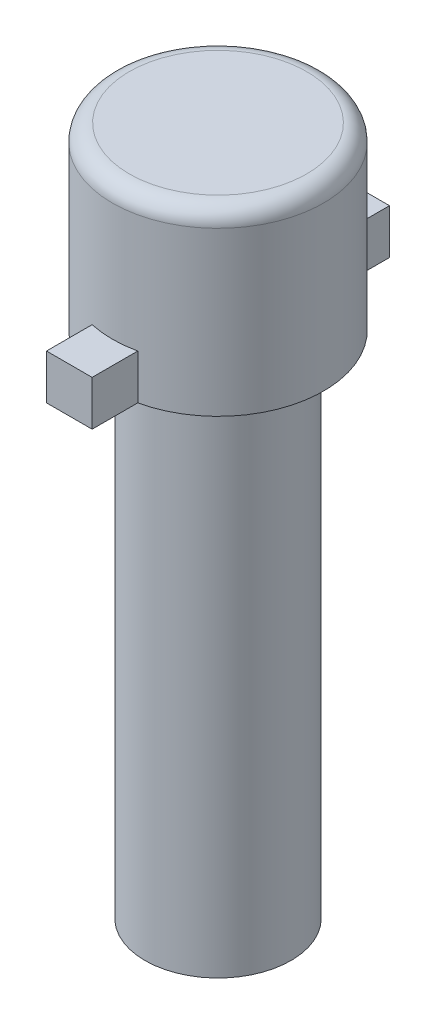
ISO-10303-21;
HEADER;
FILE_DESCRIPTION(('STEP AP214'),'2;1');
FILE_NAME('part.step','',(''),(''),'','','');
FILE_SCHEMA(('AUTOMOTIVE_DESIGN { 1 0 10303 214 1 1 1 1 }'));
ENDSEC;
DATA;
#1=APPLICATION_CONTEXT('core data for automotive mechanical design processes');
#2=APPLICATION_PROTOCOL_DEFINITION('international standard','automotive_design',2000,#1);
#3=PRODUCT_CONTEXT('',#1,'mechanical');
#4=PRODUCT('Part','Part','',(#3));
#5=PRODUCT_RELATED_PRODUCT_CATEGORY('part','',(#4));
#6=PRODUCT_DEFINITION_FORMATION('','',#4);
#7=PRODUCT_DEFINITION_CONTEXT('part definition',#1,'design');
#8=PRODUCT_DEFINITION('design','',#6,#7);
#9=PRODUCT_DEFINITION_SHAPE('','',#8);
#10=(LENGTH_UNIT() NAMED_UNIT(*) SI_UNIT(.MILLI.,.METRE.));
#11=(NAMED_UNIT(*) PLANE_ANGLE_UNIT() SI_UNIT($,.RADIAN.));
#12=(NAMED_UNIT(*) SI_UNIT($,.STERADIAN.) SOLID_ANGLE_UNIT());
#13=UNCERTAINTY_MEASURE_WITH_UNIT(LENGTH_MEASURE(1.E-05),#10,'distance_accuracy_value','');
#14=(GEOMETRIC_REPRESENTATION_CONTEXT(3) GLOBAL_UNCERTAINTY_ASSIGNED_CONTEXT((#13)) GLOBAL_UNIT_ASSIGNED_CONTEXT((#10,
#11,#12)) REPRESENTATION_CONTEXT('',''));
#15=CARTESIAN_POINT('',(0.,0.,0.));
#16=DIRECTION('',(0.,0.,1.));
#17=DIRECTION('',(1.,0.,0.));
#18=AXIS2_PLACEMENT_3D('',#15,#16,#17);
#19=CARTESIAN_POINT('',(0.,22.686,0.));
#20=DIRECTION('',(0.,-1.,0.));
#21=DIRECTION('',(0.,0.,-1.));
#22=AXIS2_PLACEMENT_3D('',#19,#20,#21);
#23=CYLINDRICAL_SURFACE('',#22,3.25);
#24=CARTESIAN_POINT('',(0.,22.686,0.));
#25=DIRECTION('',(0.,1.,0.));
#26=DIRECTION('',(0.,0.,1.));
#27=AXIS2_PLACEMENT_3D('',#24,#25,#26);
#28=CIRCLE('',#27,3.25);
#29=CARTESIAN_POINT('',(0.,22.686,3.25));
#30=VERTEX_POINT('',#29);
#31=EDGE_CURVE('E220',#30,#30,#28,.T.);
#32=ORIENTED_EDGE('',*,*,#31,.F.);
#33=EDGE_LOOP('',(#32));
#34=FACE_BOUND('',#33,.T.);
#35=CARTESIAN_POINT('',(0.,0.,0.));
#36=DIRECTION('',(0.,1.,0.));
#37=DIRECTION('',(0.,0.,1.));
#38=AXIS2_PLACEMENT_3D('',#35,#36,#37);
#39=CIRCLE('',#38,3.25);
#40=CARTESIAN_POINT('',(0.,0.,3.25));
#41=VERTEX_POINT('',#40);
#42=EDGE_CURVE('E219',#41,#41,#39,.T.);
#43=ORIENTED_EDGE('',*,*,#42,.T.);
#44=EDGE_LOOP('',(#43));
#45=FACE_BOUND('',#44,.T.);
#46=ADVANCED_FACE('F63',(#34,#45),#23,.T.);
#47=CARTESIAN_POINT('',(0.,0.,0.));
#48=DIRECTION('',(0.,1.,0.));
#49=DIRECTION('',(0.,0.,1.));
#50=AXIS2_PLACEMENT_3D('',#47,#48,#49);
#51=PLANE('',#50);
#52=ORIENTED_EDGE('',*,*,#42,.F.);
#53=EDGE_LOOP('',(#52));
#54=FACE_BOUND('',#53,.T.);
#55=ADVANCED_FACE('F249',(#54),#51,.F.);
#56=CARTESIAN_POINT('',(0.,30.686,0.));
#57=DIRECTION('',(0.,-1.,0.));
#58=DIRECTION('',(0.,0.,-1.));
#59=AXIS2_PLACEMENT_3D('',#56,#57,#58);
#60=CYLINDRICAL_SURFACE('',#59,4.7);
#61=CARTESIAN_POINT('',(0.,22.686,0.));
#62=DIRECTION('',(0.,1.,0.));
#63=DIRECTION('',(0.,0.,1.));
#64=AXIS2_PLACEMENT_3D('',#61,#62,#63);
#65=CIRCLE('',#64,4.7);
#66=CARTESIAN_POINT('',(-1.016,22.686,-4.58887175676113));
#67=VERTEX_POINT('',#66);
#68=CARTESIAN_POINT('',(-1.016,22.686,4.58887175676113));
#69=VERTEX_POINT('',#68);
#70=EDGE_CURVE('E171',#67,#69,#65,.T.);
#71=ORIENTED_EDGE('',*,*,#70,.T.);
#72=DIRECTION('',(0.,-1.,0.));
#73=VECTOR('',#72,1.);
#74=CARTESIAN_POINT('',(-1.016,24.686,4.58887175676113));
#75=LINE('',#74,#73);
#76=CARTESIAN_POINT('',(-1.016,24.686,4.58887175676113));
#77=VERTEX_POINT('',#76);
#78=EDGE_CURVE('E79',#77,#69,#75,.T.);
#79=ORIENTED_EDGE('',*,*,#78,.F.);
#80=CARTESIAN_POINT('',(0.,24.686,0.));
#81=DIRECTION('',(0.,1.,0.));
#82=DIRECTION('',(0.,0.,-1.));
#83=AXIS2_PLACEMENT_3D('',#80,#81,#82);
#84=CIRCLE('',#83,4.7);
#85=CARTESIAN_POINT('',(1.016,24.686,4.58887175676113));
#86=VERTEX_POINT('',#85);
#87=EDGE_CURVE('E83',#77,#86,#84,.T.);
#88=ORIENTED_EDGE('',*,*,#87,.T.);
#89=DIRECTION('',(0.,-1.,0.));
#90=VECTOR('',#89,1.);
#91=CARTESIAN_POINT('',(1.016,24.686,4.58887175676113));
#92=LINE('',#91,#90);
#93=CARTESIAN_POINT('',(1.016,22.686,4.58887175676113));
#94=VERTEX_POINT('',#93);
#95=EDGE_CURVE('E141',#86,#94,#92,.T.);
#96=ORIENTED_EDGE('',*,*,#95,.T.);
#97=CARTESIAN_POINT('',(1.016,22.686,-4.58887175676113));
#98=VERTEX_POINT('',#97);
#99=EDGE_CURVE('E216',#94,#98,#65,.T.);
#100=ORIENTED_EDGE('',*,*,#99,.T.);
#101=DIRECTION('',(0.,-1.,0.));
#102=VECTOR('',#101,1.);
#103=CARTESIAN_POINT('',(1.016,24.686,-4.58887175676113));
#104=LINE('',#103,#102);
#105=CARTESIAN_POINT('',(1.016,24.686,-4.58887175676113));
#106=VERTEX_POINT('',#105);
#107=EDGE_CURVE('E187',#106,#98,#104,.T.);
#108=ORIENTED_EDGE('',*,*,#107,.F.);
#109=CARTESIAN_POINT('',(0.,24.686,0.));
#110=DIRECTION('',(0.,1.,0.));
#111=DIRECTION('',(0.,0.,1.));
#112=AXIS2_PLACEMENT_3D('',#109,#110,#111);
#113=CIRCLE('',#112,4.7);
#114=CARTESIAN_POINT('',(-1.016,24.686,-4.58887175676113));
#115=VERTEX_POINT('',#114);
#116=EDGE_CURVE('E196',#106,#115,#113,.T.);
#117=ORIENTED_EDGE('',*,*,#116,.T.);
#118=DIRECTION('',(0.,-1.,0.));
#119=VECTOR('',#118,1.);
#120=CARTESIAN_POINT('',(-1.016,24.686,-4.58887175676113));
#121=LINE('',#120,#119);
#122=EDGE_CURVE('E176',#115,#67,#121,.T.);
#123=ORIENTED_EDGE('',*,*,#122,.T.);
#124=EDGE_LOOP('',(#71,#79,#88,#96,#100,#108,#117,#123));
#125=FACE_BOUND('',#124,.T.);
#126=CARTESIAN_POINT('',(0.,29.936,0.));
#127=DIRECTION('',(0.,1.,0.));
#128=DIRECTION('',(0.,0.,1.));
#129=AXIS2_PLACEMENT_3D('',#126,#127,#128);
#130=CIRCLE('',#129,4.7);
#131=CARTESIAN_POINT('',(0.,29.936,4.7));
#132=VERTEX_POINT('',#131);
#133=EDGE_CURVE('E12',#132,#132,#130,.F.);
#134=ORIENTED_EDGE('',*,*,#133,.T.);
#135=EDGE_LOOP('',(#134));
#136=FACE_BOUND('',#135,.T.);
#137=ADVANCED_FACE('F254',(#125,#136),#60,.T.);
#138=CARTESIAN_POINT('',(0.,30.686,0.));
#139=DIRECTION('',(0.,1.,0.));
#140=DIRECTION('',(0.,0.,1.));
#141=AXIS2_PLACEMENT_3D('',#138,#139,#140);
#142=PLANE('',#141);
#143=CARTESIAN_POINT('',(0.,30.686,0.));
#144=DIRECTION('',(0.,1.,0.));
#145=DIRECTION('',(0.,0.,1.));
#146=AXIS2_PLACEMENT_3D('',#143,#144,#145);
#147=CIRCLE('',#146,3.95);
#148=CARTESIAN_POINT('',(0.,30.686,3.95));
#149=VERTEX_POINT('',#148);
#150=EDGE_CURVE('E72',#149,#149,#147,.T.);
#151=ORIENTED_EDGE('',*,*,#150,.T.);
#152=EDGE_LOOP('',(#151));
#153=FACE_BOUND('',#152,.T.);
#154=ADVANCED_FACE('F230',(#153),#142,.T.);
#155=CARTESIAN_POINT('',(0.,22.686,0.));
#156=DIRECTION('',(0.,1.,0.));
#157=DIRECTION('',(0.,0.,1.));
#158=AXIS2_PLACEMENT_3D('',#155,#156,#157);
#159=PLANE('',#158);
#160=ORIENTED_EDGE('',*,*,#31,.T.);
#161=EDGE_LOOP('',(#160));
#162=FACE_BOUND('',#161,.T.);
#163=ORIENTED_EDGE('',*,*,#99,.F.);
#164=DIRECTION('',(0.,0.,1.));
#165=VECTOR('',#164,1.);
#166=CARTESIAN_POINT('',(1.016,22.686,6.62087175676113));
#167=LINE('',#166,#165);
#168=CARTESIAN_POINT('',(1.016,22.686,6.62087175676113));
#169=VERTEX_POINT('',#168);
#170=EDGE_CURVE('E160',#94,#169,#167,.T.);
#171=ORIENTED_EDGE('',*,*,#170,.T.);
#172=DIRECTION('',(-1.,0.,0.));
#173=VECTOR('',#172,1.);
#174=CARTESIAN_POINT('',(-1.016,22.686,6.62087175676113));
#175=LINE('',#174,#173);
#176=CARTESIAN_POINT('',(-1.016,22.686,6.62087175676113));
#177=VERTEX_POINT('',#176);
#178=EDGE_CURVE('E134',#169,#177,#175,.T.);
#179=ORIENTED_EDGE('',*,*,#178,.T.);
#180=DIRECTION('',(0.,0.,-1.));
#181=VECTOR('',#180,1.);
#182=CARTESIAN_POINT('',(-1.016,22.686,4.58887175676113));
#183=LINE('',#182,#181);
#184=EDGE_CURVE('E155',#177,#69,#183,.T.);
#185=ORIENTED_EDGE('',*,*,#184,.T.);
#186=ORIENTED_EDGE('',*,*,#70,.F.);
#187=DIRECTION('',(0.,0.,-1.));
#188=VECTOR('',#187,1.);
#189=CARTESIAN_POINT('',(-1.016,22.686,-4.58887175676113));
#190=LINE('',#189,#188);
#191=CARTESIAN_POINT('',(-1.016,22.686,-6.62087175676113));
#192=VERTEX_POINT('',#191);
#193=EDGE_CURVE('E163',#67,#192,#190,.T.);
#194=ORIENTED_EDGE('',*,*,#193,.T.);
#195=DIRECTION('',(1.,0.,0.));
#196=VECTOR('',#195,1.);
#197=CARTESIAN_POINT('',(-1.016,22.686,-6.62087175676113));
#198=LINE('',#197,#196);
#199=CARTESIAN_POINT('',(1.016,22.686,-6.62087175676113));
#200=VERTEX_POINT('',#199);
#201=EDGE_CURVE('E195',#192,#200,#198,.T.);
#202=ORIENTED_EDGE('',*,*,#201,.T.);
#203=DIRECTION('',(0.,0.,1.));
#204=VECTOR('',#203,1.);
#205=CARTESIAN_POINT('',(1.016,22.686,-6.62087175676113));
#206=LINE('',#205,#204);
#207=EDGE_CURVE('E191',#200,#98,#206,.T.);
#208=ORIENTED_EDGE('',*,*,#207,.T.);
#209=EDGE_LOOP('',(#163,#171,#179,#185,#186,#194,#202,#208));
#210=FACE_BOUND('',#209,.T.);
#211=ADVANCED_FACE('F234',(#162,#210),#159,.F.);
#212=CARTESIAN_POINT('',(0.,29.936,0.));
#213=DIRECTION('',(0.,1.,0.));
#214=DIRECTION('',(0.,0.,1.));
#215=AXIS2_PLACEMENT_3D('',#212,#213,#214);
#216=TOROIDAL_SURFACE('',#215,3.95,0.75);
#217=ORIENTED_EDGE('',*,*,#133,.F.);
#218=EDGE_LOOP('',(#217));
#219=FACE_BOUND('',#218,.T.);
#220=ORIENTED_EDGE('',*,*,#150,.F.);
#221=EDGE_LOOP('',(#220));
#222=FACE_BOUND('',#221,.T.);
#223=ADVANCED_FACE('F65',(#219,#222),#216,.T.);
#224=CARTESIAN_POINT('',(1.016,24.686,-6.62087175676113));
#225=DIRECTION('',(1.,0.,0.));
#226=DIRECTION('',(0.,0.,-1.));
#227=AXIS2_PLACEMENT_3D('',#224,#225,#226);
#228=PLANE('',#227);
#229=ORIENTED_EDGE('',*,*,#207,.F.);
#230=DIRECTION('',(0.,-1.,0.));
#231=VECTOR('',#230,1.);
#232=CARTESIAN_POINT('',(1.016,24.686,-6.62087175676113));
#233=LINE('',#232,#231);
#234=CARTESIAN_POINT('',(1.016,24.686,-6.62087175676113));
#235=VERTEX_POINT('',#234);
#236=EDGE_CURVE('E184',#235,#200,#233,.T.);
#237=ORIENTED_EDGE('',*,*,#236,.F.);
#238=DIRECTION('',(0.,0.,1.));
#239=VECTOR('',#238,1.);
#240=CARTESIAN_POINT('',(1.016,24.686,-6.62087175676113));
#241=LINE('',#240,#239);
#242=EDGE_CURVE('E180',#235,#106,#241,.T.);
#243=ORIENTED_EDGE('',*,*,#242,.T.);
#244=ORIENTED_EDGE('',*,*,#107,.T.);
#245=EDGE_LOOP('',(#229,#237,#243,#244));
#246=FACE_BOUND('',#245,.T.);
#247=ADVANCED_FACE('F233',(#246),#228,.T.);
#248=CARTESIAN_POINT('',(-1.016,24.686,-6.62087175676113));
#249=DIRECTION('',(0.,0.,-1.));
#250=DIRECTION('',(-1.,0.,0.));
#251=AXIS2_PLACEMENT_3D('',#248,#249,#250);
#252=PLANE('',#251);
#253=ORIENTED_EDGE('',*,*,#201,.F.);
#254=DIRECTION('',(0.,-1.,0.));
#255=VECTOR('',#254,1.);
#256=CARTESIAN_POINT('',(-1.016,24.686,-6.62087175676113));
#257=LINE('',#256,#255);
#258=CARTESIAN_POINT('',(-1.016,24.686,-6.62087175676113));
#259=VERTEX_POINT('',#258);
#260=EDGE_CURVE('E181',#259,#192,#257,.T.);
#261=ORIENTED_EDGE('',*,*,#260,.F.);
#262=DIRECTION('',(1.,0.,0.));
#263=VECTOR('',#262,1.);
#264=CARTESIAN_POINT('',(-1.016,24.686,-6.62087175676113));
#265=LINE('',#264,#263);
#266=EDGE_CURVE('E206',#259,#235,#265,.T.);
#267=ORIENTED_EDGE('',*,*,#266,.T.);
#268=ORIENTED_EDGE('',*,*,#236,.T.);
#269=EDGE_LOOP('',(#253,#261,#267,#268));
#270=FACE_BOUND('',#269,.T.);
#271=ADVANCED_FACE('F241',(#270),#252,.T.);
#272=CARTESIAN_POINT('',(-1.016,24.686,-4.58887175676113));
#273=DIRECTION('',(-1.,0.,0.));
#274=DIRECTION('',(0.,0.,1.));
#275=AXIS2_PLACEMENT_3D('',#272,#273,#274);
#276=PLANE('',#275);
#277=ORIENTED_EDGE('',*,*,#193,.F.);
#278=ORIENTED_EDGE('',*,*,#122,.F.);
#279=DIRECTION('',(0.,0.,-1.));
#280=VECTOR('',#279,1.);
#281=CARTESIAN_POINT('',(-1.016,24.686,-4.58887175676113));
#282=LINE('',#281,#280);
#283=EDGE_CURVE('E210',#115,#259,#282,.T.);
#284=ORIENTED_EDGE('',*,*,#283,.T.);
#285=ORIENTED_EDGE('',*,*,#260,.T.);
#286=EDGE_LOOP('',(#277,#278,#284,#285));
#287=FACE_BOUND('',#286,.T.);
#288=ADVANCED_FACE('F265',(#287),#276,.T.);
#289=CARTESIAN_POINT('',(0.,24.686,0.));
#290=DIRECTION('',(0.,1.,0.));
#291=DIRECTION('',(0.,0.,1.));
#292=AXIS2_PLACEMENT_3D('',#289,#290,#291);
#293=PLANE('',#292);
#294=ORIENTED_EDGE('',*,*,#116,.F.);
#295=ORIENTED_EDGE('',*,*,#242,.F.);
#296=ORIENTED_EDGE('',*,*,#266,.F.);
#297=ORIENTED_EDGE('',*,*,#283,.F.);
#298=EDGE_LOOP('',(#294,#295,#296,#297));
#299=FACE_BOUND('',#298,.T.);
#300=ADVANCED_FACE('F262',(#299),#293,.T.);
#301=CARTESIAN_POINT('',(-1.016,24.686,4.58887175676113));
#302=DIRECTION('',(-1.,0.,0.));
#303=DIRECTION('',(0.,0.,1.));
#304=AXIS2_PLACEMENT_3D('',#301,#302,#303);
#305=PLANE('',#304);
#306=ORIENTED_EDGE('',*,*,#184,.F.);
#307=DIRECTION('',(0.,-1.,0.));
#308=VECTOR('',#307,1.);
#309=CARTESIAN_POINT('',(-1.016,24.686,6.62087175676113));
#310=LINE('',#309,#308);
#311=CARTESIAN_POINT('',(-1.016,24.686,6.62087175676113));
#312=VERTEX_POINT('',#311);
#313=EDGE_CURVE('E140',#312,#177,#310,.T.);
#314=ORIENTED_EDGE('',*,*,#313,.F.);
#315=DIRECTION('',(0.,0.,-1.));
#316=VECTOR('',#315,1.);
#317=CARTESIAN_POINT('',(-1.016,24.686,4.58887175676113));
#318=LINE('',#317,#316);
#319=EDGE_CURVE('E148',#312,#77,#318,.T.);
#320=ORIENTED_EDGE('',*,*,#319,.T.);
#321=ORIENTED_EDGE('',*,*,#78,.T.);
#322=EDGE_LOOP('',(#306,#314,#320,#321));
#323=FACE_BOUND('',#322,.T.);
#324=ADVANCED_FACE('F264',(#323),#305,.T.);
#325=CARTESIAN_POINT('',(-1.016,24.686,6.62087175676113));
#326=DIRECTION('',(0.,0.,1.));
#327=DIRECTION('',(1.,0.,0.));
#328=AXIS2_PLACEMENT_3D('',#325,#326,#327);
#329=PLANE('',#328);
#330=ORIENTED_EDGE('',*,*,#178,.F.);
#331=DIRECTION('',(0.,-1.,0.));
#332=VECTOR('',#331,1.);
#333=CARTESIAN_POINT('',(1.016,24.686,6.62087175676113));
#334=LINE('',#333,#332);
#335=CARTESIAN_POINT('',(1.016,24.686,6.62087175676113));
#336=VERTEX_POINT('',#335);
#337=EDGE_CURVE('E128',#336,#169,#334,.T.);
#338=ORIENTED_EDGE('',*,*,#337,.F.);
#339=DIRECTION('',(-1.,0.,0.));
#340=VECTOR('',#339,1.);
#341=CARTESIAN_POINT('',(-1.016,24.686,6.62087175676113));
#342=LINE('',#341,#340);
#343=EDGE_CURVE('E131',#336,#312,#342,.T.);
#344=ORIENTED_EDGE('',*,*,#343,.T.);
#345=ORIENTED_EDGE('',*,*,#313,.T.);
#346=EDGE_LOOP('',(#330,#338,#344,#345));
#347=FACE_BOUND('',#346,.T.);
#348=ADVANCED_FACE('F130',(#347),#329,.T.);
#349=CARTESIAN_POINT('',(1.016,24.686,6.62087175676113));
#350=DIRECTION('',(1.,0.,0.));
#351=DIRECTION('',(0.,0.,-1.));
#352=AXIS2_PLACEMENT_3D('',#349,#350,#351);
#353=PLANE('',#352);
#354=ORIENTED_EDGE('',*,*,#170,.F.);
#355=ORIENTED_EDGE('',*,*,#95,.F.);
#356=DIRECTION('',(0.,0.,1.));
#357=VECTOR('',#356,1.);
#358=CARTESIAN_POINT('',(1.016,24.686,6.62087175676113));
#359=LINE('',#358,#357);
#360=EDGE_CURVE('E146',#86,#336,#359,.T.);
#361=ORIENTED_EDGE('',*,*,#360,.T.);
#362=ORIENTED_EDGE('',*,*,#337,.T.);
#363=EDGE_LOOP('',(#354,#355,#361,#362));
#364=FACE_BOUND('',#363,.T.);
#365=ADVANCED_FACE('F151',(#364),#353,.T.);
#366=CARTESIAN_POINT('',(0.,24.686,0.));
#367=DIRECTION('',(0.,-1.,0.));
#368=DIRECTION('',(0.,0.,-1.));
#369=AXIS2_PLACEMENT_3D('',#366,#367,#368);
#370=PLANE('',#369);
#371=ORIENTED_EDGE('',*,*,#87,.F.);
#372=ORIENTED_EDGE('',*,*,#319,.F.);
#373=ORIENTED_EDGE('',*,*,#343,.F.);
#374=ORIENTED_EDGE('',*,*,#360,.F.);
#375=EDGE_LOOP('',(#371,#372,#373,#374));
#376=FACE_BOUND('',#375,.T.);
#377=ADVANCED_FACE('F145',(#376),#370,.F.);
#378=CLOSED_SHELL('',(#46,#55,#137,#154,#211,#223,#247,#271,#288,#300,#324,#348,#365,#377));
#379=MANIFOLD_SOLID_BREP('B2',#378);
#380=ADVANCED_BREP_SHAPE_REPRESENTATION('',(#18,#379),#14);
#381=SHAPE_DEFINITION_REPRESENTATION(#9,#380);
ENDSEC;
END-ISO-10303-21;
